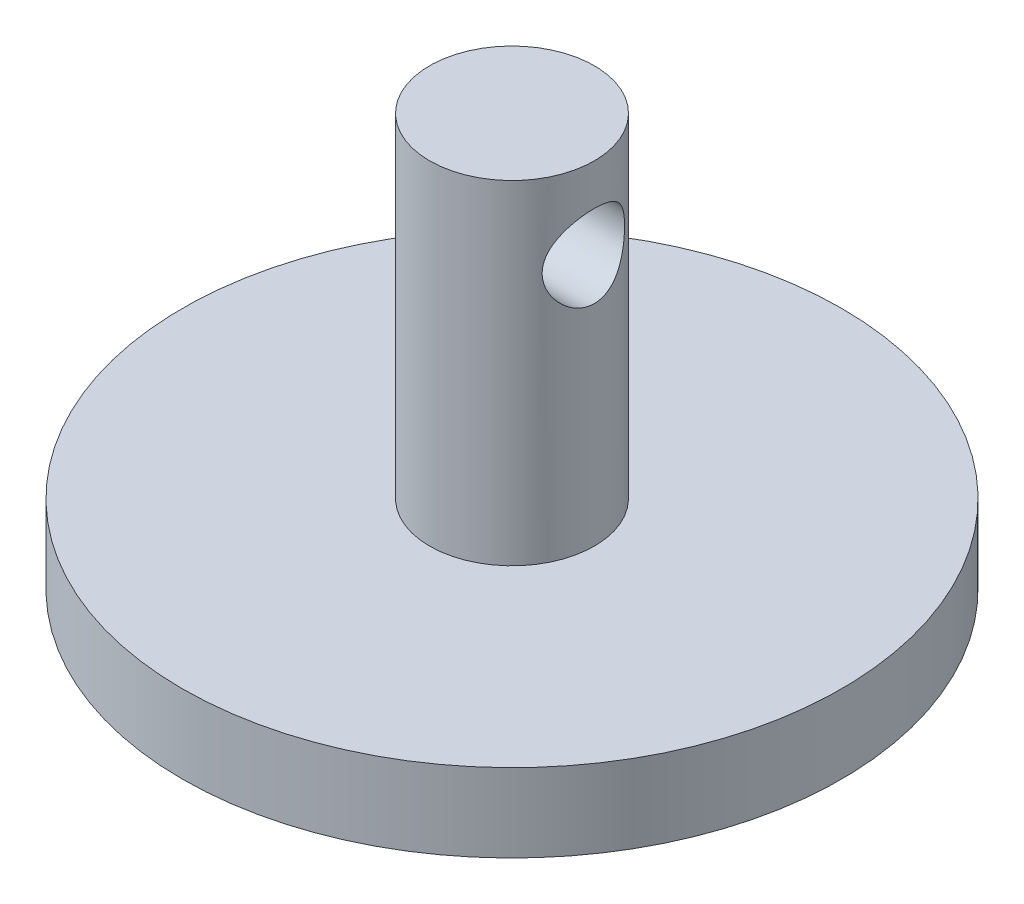
ISO-10303-21;
HEADER;
FILE_DESCRIPTION(('STEP AP214'),'2;1');
FILE_NAME('part.step','',(''),(''),'','','');
FILE_SCHEMA(('AUTOMOTIVE_DESIGN { 1 0 10303 214 1 1 1 1 }'));
ENDSEC;
DATA;
#1=APPLICATION_CONTEXT('core data for automotive mechanical design processes');
#2=APPLICATION_PROTOCOL_DEFINITION('international standard','automotive_design',2000,#1);
#3=PRODUCT_CONTEXT('',#1,'mechanical');
#4=PRODUCT('Part','Part','',(#3));
#5=PRODUCT_RELATED_PRODUCT_CATEGORY('part','',(#4));
#6=PRODUCT_DEFINITION_FORMATION('','',#4);
#7=PRODUCT_DEFINITION_CONTEXT('part definition',#1,'design');
#8=PRODUCT_DEFINITION('design','',#6,#7);
#9=PRODUCT_DEFINITION_SHAPE('','',#8);
#10=(LENGTH_UNIT() NAMED_UNIT(*) SI_UNIT(.MILLI.,.METRE.));
#11=(NAMED_UNIT(*) PLANE_ANGLE_UNIT() SI_UNIT($,.RADIAN.));
#12=(NAMED_UNIT(*) SI_UNIT($,.STERADIAN.) SOLID_ANGLE_UNIT());
#13=UNCERTAINTY_MEASURE_WITH_UNIT(LENGTH_MEASURE(1.E-05),#10,'distance_accuracy_value','');
#14=(GEOMETRIC_REPRESENTATION_CONTEXT(3) GLOBAL_UNCERTAINTY_ASSIGNED_CONTEXT((#13)) GLOBAL_UNIT_ASSIGNED_CONTEXT((#10,
#11,#12)) REPRESENTATION_CONTEXT('',''));
#15=CARTESIAN_POINT('',(0.,0.,0.));
#16=DIRECTION('',(0.,0.,1.));
#17=DIRECTION('',(1.,0.,0.));
#18=AXIS2_PLACEMENT_3D('',#15,#16,#17);
#19=CARTESIAN_POINT('',(0.,0.,0.));
#20=DIRECTION('',(0.,-1.,0.));
#21=DIRECTION('',(0.,0.,-1.));
#22=AXIS2_PLACEMENT_3D('',#19,#20,#21);
#23=PLANE('',#22);
#24=CARTESIAN_POINT('',(0.,0.,0.));
#25=DIRECTION('',(0.,1.,0.));
#26=DIRECTION('',(0.,0.,1.));
#27=AXIS2_PLACEMENT_3D('',#24,#25,#26);
#28=CIRCLE('',#27,8.);
#29=CARTESIAN_POINT('',(0.,0.,8.));
#30=VERTEX_POINT('',#29);
#31=EDGE_CURVE('E10',#30,#30,#28,.T.);
#32=ORIENTED_EDGE('',*,*,#31,.F.);
#33=EDGE_LOOP('',(#32));
#34=FACE_BOUND('',#33,.T.);
#35=ADVANCED_FACE('F34',(#34),#23,.T.);
#36=CARTESIAN_POINT('',(0.,10.,0.));
#37=DIRECTION('',(0.,1.,0.));
#38=DIRECTION('',(0.,0.,1.));
#39=AXIS2_PLACEMENT_3D('',#36,#37,#38);
#40=CYLINDRICAL_SURFACE('',#39,8.);
#41=ORIENTED_EDGE('',*,*,#31,.T.);
#42=EDGE_LOOP('',(#41));
#43=FACE_BOUND('',#42,.T.);
#44=CARTESIAN_POINT('',(0.,1.9,0.));
#45=DIRECTION('',(0.,1.,0.));
#46=DIRECTION('',(0.,0.,1.));
#47=AXIS2_PLACEMENT_3D('',#44,#45,#46);
#48=CIRCLE('',#47,8.);
#49=CARTESIAN_POINT('',(0.,1.9,8.));
#50=VERTEX_POINT('',#49);
#51=EDGE_CURVE('E46',#50,#50,#48,.T.);
#52=ORIENTED_EDGE('',*,*,#51,.F.);
#53=EDGE_LOOP('',(#52));
#54=FACE_BOUND('',#53,.T.);
#55=ADVANCED_FACE('F78',(#43,#54),#40,.T.);
#56=CARTESIAN_POINT('',(0.,1.9,8.));
#57=DIRECTION('',(0.,1.,0.));
#58=DIRECTION('',(0.,0.,1.));
#59=AXIS2_PLACEMENT_3D('',#56,#57,#58);
#60=PLANE('',#59);
#61=ORIENTED_EDGE('',*,*,#51,.T.);
#62=EDGE_LOOP('',(#61));
#63=FACE_BOUND('',#62,.T.);
#64=CARTESIAN_POINT('',(0.,1.9,0.));
#65=DIRECTION('',(0.,1.,0.));
#66=DIRECTION('',(0.,0.,1.));
#67=AXIS2_PLACEMENT_3D('',#64,#65,#66);
#68=CIRCLE('',#67,2.);
#69=CARTESIAN_POINT('',(0.,1.9,2.));
#70=VERTEX_POINT('',#69);
#71=EDGE_CURVE('E51',#70,#70,#68,.T.);
#72=ORIENTED_EDGE('',*,*,#71,.F.);
#73=EDGE_LOOP('',(#72));
#74=FACE_BOUND('',#73,.T.);
#75=ADVANCED_FACE('F74',(#63,#74),#60,.T.);
#76=CARTESIAN_POINT('',(0.,10.,0.));
#77=DIRECTION('',(0.,1.,0.));
#78=DIRECTION('',(0.,0.,1.));
#79=AXIS2_PLACEMENT_3D('',#76,#77,#78);
#80=CYLINDRICAL_SURFACE('',#79,2.);
#81=CARTESIAN_POINT('',(-1.73205080756888,8.,-1.));
#82=CARTESIAN_POINT('',(-1.73205534728459,7.94789219180475,-0.999996363074532));
#83=CARTESIAN_POINT('',(-1.73443801187756,7.89571858847496,-0.995899970733217));
#84=CARTESIAN_POINT('',(-1.74362366452052,7.79297273532285,-0.979723209898054));
#85=CARTESIAN_POINT('',(-1.75043594055559,7.74240408495659,-0.967626064554179));
#86=CARTESIAN_POINT('',(-1.76749346605398,7.64454833565606,-0.936099948699813));
#87=CARTESIAN_POINT('',(-1.77772043473252,7.59724534752641,-0.916709952493731));
#88=CARTESIAN_POINT('',(-1.80042664816858,7.50657579800328,-0.871267525376372));
#89=CARTESIAN_POINT('',(-1.81290601476065,7.46320944973754,-0.845214734035774));
#90=CARTESIAN_POINT('',(-1.83996869057441,7.3776942714425,-0.784666540530879));
#91=CARTESIAN_POINT('',(-1.85464063637954,7.33594086432646,-0.749652036143771));
#92=CARTESIAN_POINT('',(-1.88371982785706,7.25859161159329,-0.673253807614469));
#93=CARTESIAN_POINT('',(-1.8981269383125,7.22299883741648,-0.631866925782293));
#94=CARTESIAN_POINT('',(-1.92621476952949,7.15663284885234,-0.540489563414546));
#95=CARTESIAN_POINT('',(-1.93978106418172,7.12634623214047,-0.490107189012575));
#96=CARTESIAN_POINT('',(-1.96350756099529,7.07485914675424,-0.384157026599505));
#97=CARTESIAN_POINT('',(-1.97366991183742,7.05365294386283,-0.328592538138156));
#98=CARTESIAN_POINT('',(-1.98880461244237,7.0224953386989,-0.218044943925978));
#99=CARTESIAN_POINT('',(-1.99409480220892,7.01185047364447,-0.163301790488818));
#100=CARTESIAN_POINT('',(-2.00007583846067,6.99983388132496,-0.0525706286978487));
#101=CARTESIAN_POINT('',(-2.0007694678459,6.99845654320429,0.00341660584373789));
#102=CARTESIAN_POINT('',(-1.9976298191645,7.00474667397035,0.10983252442375));
#103=CARTESIAN_POINT('',(-1.9941849589216,7.01163801552122,0.160321199176791));
#104=CARTESIAN_POINT('',(-1.98374245259747,7.03288084390466,0.259313771918322));
#105=CARTESIAN_POINT('',(-1.97674454066394,7.04723288897622,0.307817521093925));
#106=CARTESIAN_POINT('',(-1.95971583287654,7.08308256608981,0.402309391569553));
#107=CARTESIAN_POINT('',(-1.94964441529199,7.10467631317207,0.448253423515178));
#108=CARTESIAN_POINT('',(-1.92737645986687,7.15426341620149,0.535976801513328));
#109=CARTESIAN_POINT('',(-1.91517916157484,7.18225906330235,0.577754648838645));
#110=CARTESIAN_POINT('',(-1.88844394399229,7.24689535153302,0.660173660898195));
#111=CARTESIAN_POINT('',(-1.87379375998175,7.28410302832601,0.70033407502936));
#112=CARTESIAN_POINT('',(-1.84454340586812,7.36458972493018,0.77410437029778));
#113=CARTESIAN_POINT('',(-1.82994328265629,7.40787337227406,0.807709211574231));
#114=CARTESIAN_POINT('',(-1.80144156092485,7.50264819242409,0.869505334642211));
#115=CARTESIAN_POINT('',(-1.78764319990708,7.55448602305421,0.897217314978052));
#116=CARTESIAN_POINT('',(-1.76375450278576,7.662937671359,0.943319113001232));
#117=CARTESIAN_POINT('',(-1.75366030046067,7.71954643301756,0.96171865821089));
#118=CARTESIAN_POINT('',(-1.73944635817034,7.83121451128279,0.98718021102504));
#119=CARTESIAN_POINT('',(-1.73491655848496,7.88604111904355,0.995025122119976));
#120=CARTESIAN_POINT('',(-1.73117919361609,7.99640134151654,1.00151694661143));
#121=CARTESIAN_POINT('',(-1.73196786889312,8.05193442911978,1.00017035731503));
#122=CARTESIAN_POINT('',(-1.73834336540585,8.15565391857873,0.989036043343967));
#123=CARTESIAN_POINT('',(-1.74339587506654,8.20397945110792,0.980187816712468));
#124=CARTESIAN_POINT('',(-1.75694021551341,8.29836778627096,0.955696284632442));
#125=CARTESIAN_POINT('',(-1.76543316005034,8.34442985074661,0.940050778623615));
#126=CARTESIAN_POINT('',(-1.78536222079657,8.4354113309027,0.901647588604887));
#127=CARTESIAN_POINT('',(-1.79691643243063,8.48017901685355,0.878594063692725));
#128=CARTESIAN_POINT('',(-1.8215611949725,8.56546927153899,0.826287064015806));
#129=CARTESIAN_POINT('',(-1.83465253355148,8.60598964351328,0.797030404332217));
#130=CARTESIAN_POINT('',(-1.86287998456336,8.68697876752355,0.728837167198855));
#131=CARTESIAN_POINT('',(-1.87806583154289,8.72679715071766,0.689145272314968));
#132=CARTESIAN_POINT('',(-1.90734234977892,8.79941223799359,0.60340449539829));
#133=CARTESIAN_POINT('',(-1.92143265007709,8.83220657023054,0.557353474655348));
#134=CARTESIAN_POINT('',(-1.94741361690957,8.8905737259501,0.458535362558758));
#135=CARTESIAN_POINT('',(-1.95923641672029,8.91593311821091,0.405623097574114));
#136=CARTESIAN_POINT('',(-1.97883354959301,8.95713790385739,0.295522364641083));
#137=CARTESIAN_POINT('',(-1.98661143676373,8.97299165136631,0.238337701392177));
#138=CARTESIAN_POINT('',(-1.99667508181883,8.99336856417466,0.126979682330418));
#139=CARTESIAN_POINT('',(-1.99939927908191,8.99879787587611,0.0730114438504575));
#140=CARTESIAN_POINT('',(-2.00042130375131,9.0008432654544,-0.0351259859512031));
#141=CARTESIAN_POINT('',(-1.9987206806689,8.99746242852357,-0.0892951002950863));
#142=CARTESIAN_POINT('',(-1.99133968837923,8.98258359320438,-0.192537992317146));
#143=CARTESIAN_POINT('',(-1.9859289466799,8.97163515074233,-0.241712317811263));
#144=CARTESIAN_POINT('',(-1.97192093663423,8.94267300069703,-0.337445952183617));
#145=CARTESIAN_POINT('',(-1.96332321132796,8.92465827990655,-0.384004884955508));
#146=CARTESIAN_POINT('',(-1.9432593074812,8.88127294783403,-0.475423406244884));
#147=CARTESIAN_POINT('',(-1.93168617198799,8.85562067679216,-0.520125142700046));
#148=CARTESIAN_POINT('',(-1.90688133141826,8.79804206914095,-0.604774641814024));
#149=CARTESIAN_POINT('',(-1.89364886558361,8.76611285088433,-0.644720207414907));
#150=CARTESIAN_POINT('',(-1.86528610226628,8.6932028609773,-0.722914004156891));
#151=CARTESIAN_POINT('',(-1.85009799011698,8.65163751252281,-0.760597684539272));
#152=CARTESIAN_POINT('',(-1.82063076162852,8.56254927887023,-0.828663287394676));
#153=CARTESIAN_POINT('',(-1.80635245761865,8.51502117913232,-0.859038750010059));
#154=CARTESIAN_POINT('',(-1.77999605304916,8.41336335341905,-0.912431079785654));
#155=CARTESIAN_POINT('',(-1.7680017425627,8.35907246887126,-0.935185065960939));
#156=CARTESIAN_POINT('',(-1.74866156328352,8.24666759566022,-0.970878709506412));
#157=CARTESIAN_POINT('',(-1.74130016147702,8.18856711108731,-0.983851191175347));
#158=CARTESIAN_POINT('',(-1.7352927260179,8.10819464434801,-0.994367007864415));
#159=CARTESIAN_POINT('',(-1.73408129005152,8.08663210560212,-0.996476104963851));
#160=CARTESIAN_POINT('',(-1.7324593588775,8.04338351931776,-0.999293405089963));
#161=CARTESIAN_POINT('',(-1.73204891725109,8.02169746361413,-1.00000151439987));
#162=CARTESIAN_POINT('',(-1.73205080756888,8.,-1.));
#163=B_SPLINE_CURVE_WITH_KNOTS('',3,(#81,#82,#83,#84,#85,#86,#87,#88,#89,#90,#91,#92,#93,#94,
#95,#96,#97,#98,#99,#100,#101,#102,#103,#104,#105,#106,#107,#108,#109,#110,#111,#112,#113,#114,
#115,#116,#117,#118,#119,#120,#121,#122,#123,#124,#125,#126,#127,#128,#129,#130,#131,#132,#133,
#134,#135,#136,#137,#138,#139,#140,#141,#142,#143,#144,#145,#146,#147,#148,#149,#150,#151,#152,
#153,#154,#155,#156,#157,#158,#159,#160,#161,#162),.UNSPECIFIED.,.T.,.F.,(4,2,2,2,2,2,2,2,2,2,2,
2,2,2,2,2,2,2,2,2,2,2,2,2,2,2,2,2,2,2,2,2,2,2,2,2,2,2,2,2,4),(0.,0.156232122594715,
0.312792892824805,0.468528595918885,0.624272725445149,0.792862312498233,0.96153571084371,
1.14157892238763,1.32150826963891,1.48863484967935,1.6556602368604,1.80816097484538,
1.96067312517455,2.11529534731147,2.26997299350272,2.43927191456891,2.60870048245919,
2.78888841729448,2.96888774211705,3.13462290854212,3.30024093188373,3.44774183424025,
3.59529052436063,3.74967296406088,3.90413486220047,4.07806743580613,4.25205864978202,
4.43064181412966,4.60906779808772,4.77112270389487,4.93312086793972,5.08444424871493,
5.23578933512013,5.39360750719472,5.55149830100719,5.72510241850068,5.89885942845154,
6.07810749038605,6.2567513300276,6.3218013518531,6.38685572494541),.UNSPECIFIED.);
#164=CARTESIAN_POINT('',(-1.73205080756888,8.,-1.));
#165=VERTEX_POINT('',#164);
#166=EDGE_CURVE('E37',#165,#165,#163,.T.);
#167=ORIENTED_EDGE('',*,*,#166,.F.);
#168=EDGE_LOOP('',(#167));
#169=FACE_BOUND('',#168,.T.);
#170=CARTESIAN_POINT('',(1.73205080756888,8.,-1.));
#171=CARTESIAN_POINT('',(1.73205534728459,8.05210780819525,-0.999996363074532));
#172=CARTESIAN_POINT('',(1.73443801187756,8.10428141152505,-0.995899970733217));
#173=CARTESIAN_POINT('',(1.74362366452052,8.20702726467715,-0.979723209898054));
#174=CARTESIAN_POINT('',(1.75043594055559,8.25759591504341,-0.96762606455418));
#175=CARTESIAN_POINT('',(1.76749346605398,8.35545166434394,-0.936099948699813));
#176=CARTESIAN_POINT('',(1.77772043473252,8.40275465247359,-0.916709952493731));
#177=CARTESIAN_POINT('',(1.80042664816858,8.49342420199672,-0.871267525376372));
#178=CARTESIAN_POINT('',(1.81290601476065,8.53679055026246,-0.845214734035774));
#179=CARTESIAN_POINT('',(1.83996869057441,8.62230572855751,-0.78466654053088));
#180=CARTESIAN_POINT('',(1.85464063637953,8.66405913567354,-0.749652036143771));
#181=CARTESIAN_POINT('',(1.88371982785706,8.74140838840671,-0.673253807614469));
#182=CARTESIAN_POINT('',(1.8981269383125,8.77700116258352,-0.631866925782293));
#183=CARTESIAN_POINT('',(1.92621476952949,8.84336715114766,-0.540489563414547));
#184=CARTESIAN_POINT('',(1.93978106418172,8.87365376785953,-0.490107189012576));
#185=CARTESIAN_POINT('',(1.96350756099529,8.92514085324576,-0.384157026599506));
#186=CARTESIAN_POINT('',(1.97366991183742,8.94634705613717,-0.328592538138157));
#187=CARTESIAN_POINT('',(1.98880461244237,8.9775046613011,-0.218044943925979));
#188=CARTESIAN_POINT('',(1.99409480220892,8.98814952635553,-0.163301790488819));
#189=CARTESIAN_POINT('',(2.00007583846067,9.00016611867504,-0.0525706286978493));
#190=CARTESIAN_POINT('',(2.0007694678459,9.00154345679571,0.00341660584373763));
#191=CARTESIAN_POINT('',(1.9976298191645,8.99525332602965,0.10983252442375));
#192=CARTESIAN_POINT('',(1.9941849589216,8.98836198447878,0.160321199176791));
#193=CARTESIAN_POINT('',(1.98374245259747,8.96711915609534,0.259313771918322));
#194=CARTESIAN_POINT('',(1.97674454066394,8.95276711102378,0.307817521093925));
#195=CARTESIAN_POINT('',(1.95971583287654,8.91691743391019,0.402309391569553));
#196=CARTESIAN_POINT('',(1.94964441529199,8.89532368682793,0.448253423515178));
#197=CARTESIAN_POINT('',(1.92737645986687,8.84573658379851,0.535976801513328));
#198=CARTESIAN_POINT('',(1.91517916157484,8.81774093669765,0.577754648838645));
#199=CARTESIAN_POINT('',(1.88844394399229,8.75310464846699,0.660173660898194));
#200=CARTESIAN_POINT('',(1.87379375998175,8.71589697167399,0.70033407502936));
#201=CARTESIAN_POINT('',(1.84454340586812,8.63541027506983,0.774104370297779));
#202=CARTESIAN_POINT('',(1.82994328265629,8.59212662772594,0.80770921157423));
#203=CARTESIAN_POINT('',(1.80144156092485,8.49735180757591,0.869505334642211));
#204=CARTESIAN_POINT('',(1.78764319990708,8.44551397694579,0.897217314978051));
#205=CARTESIAN_POINT('',(1.76375450278576,8.337062328641,0.943319113001232));
#206=CARTESIAN_POINT('',(1.75366030046067,8.28045356698244,0.96171865821089));
#207=CARTESIAN_POINT('',(1.73944635817034,8.16878548871721,0.98718021102504));
#208=CARTESIAN_POINT('',(1.73491655848496,8.11395888095645,0.995025122119976));
#209=CARTESIAN_POINT('',(1.73117919361609,8.00359865848346,1.00151694661143));
#210=CARTESIAN_POINT('',(1.73196786889312,7.94806557088022,1.00017035731503));
#211=CARTESIAN_POINT('',(1.73834336540585,7.84434608142127,0.989036043343966));
#212=CARTESIAN_POINT('',(1.74339587506654,7.79602054889207,0.980187816712468));
#213=CARTESIAN_POINT('',(1.75694021551341,7.70163221372904,0.955696284632441));
#214=CARTESIAN_POINT('',(1.76543316005034,7.65557014925339,0.940050778623615));
#215=CARTESIAN_POINT('',(1.78536222079657,7.5645886690973,0.901647588604886));
#216=CARTESIAN_POINT('',(1.79691643243063,7.51982098314645,0.878594063692724));
#217=CARTESIAN_POINT('',(1.8215611949725,7.43453072846101,0.826287064015805));
#218=CARTESIAN_POINT('',(1.83465253355148,7.39401035648672,0.797030404332217));
#219=CARTESIAN_POINT('',(1.86287998456336,7.31302123247645,0.728837167198854));
#220=CARTESIAN_POINT('',(1.87806583154289,7.27320284928234,0.689145272314967));
#221=CARTESIAN_POINT('',(1.90734234977892,7.20058776200641,0.603404495398289));
#222=CARTESIAN_POINT('',(1.92143265007709,7.16779342976946,0.557353474655348));
#223=CARTESIAN_POINT('',(1.94741361690957,7.1094262740499,0.458535362558757));
#224=CARTESIAN_POINT('',(1.95923641672029,7.08406688178909,0.405623097574113));
#225=CARTESIAN_POINT('',(1.97883354959301,7.04286209614261,0.295522364641082));
#226=CARTESIAN_POINT('',(1.98661143676373,7.02700834863369,0.238337701392176));
#227=CARTESIAN_POINT('',(1.99667508181883,7.00663143582534,0.126979682330418));
#228=CARTESIAN_POINT('',(1.99939927908191,7.00120212412389,0.0730114438504575));
#229=CARTESIAN_POINT('',(2.00042130375131,6.9991567345456,-0.0351259859512032));
#230=CARTESIAN_POINT('',(1.9987206806689,7.00253757147644,-0.0892951002950864));
#231=CARTESIAN_POINT('',(1.99133968837923,7.01741640679562,-0.192537992317147));
#232=CARTESIAN_POINT('',(1.9859289466799,7.02836484925767,-0.241712317811263));
#233=CARTESIAN_POINT('',(1.97192093663423,7.05732699930297,-0.337445952183617));
#234=CARTESIAN_POINT('',(1.96332321132796,7.07534172009345,-0.384004884955508));
#235=CARTESIAN_POINT('',(1.9432593074812,7.11872705216597,-0.475423406244884));
#236=CARTESIAN_POINT('',(1.93168617198799,7.14437932320784,-0.520125142700046));
#237=CARTESIAN_POINT('',(1.90688133141826,7.20195793085905,-0.604774641814024));
#238=CARTESIAN_POINT('',(1.89364886558361,7.23388714911567,-0.644720207414907));
#239=CARTESIAN_POINT('',(1.86528610226628,7.3067971390227,-0.722914004156891));
#240=CARTESIAN_POINT('',(1.85009799011698,7.34836248747719,-0.760597684539272));
#241=CARTESIAN_POINT('',(1.82063076162852,7.43745072112977,-0.828663287394675));
#242=CARTESIAN_POINT('',(1.80635245761865,7.48497882086768,-0.859038750010058));
#243=CARTESIAN_POINT('',(1.77999605304916,7.58663664658096,-0.912431079785655));
#244=CARTESIAN_POINT('',(1.7680017425627,7.64092753112874,-0.93518506596094));
#245=CARTESIAN_POINT('',(1.74866156328351,7.75333240433978,-0.970878709506412));
#246=CARTESIAN_POINT('',(1.74130016147702,7.81143288891269,-0.983851191175347));
#247=CARTESIAN_POINT('',(1.7352927260179,7.891805355652,-0.994367007864415));
#248=CARTESIAN_POINT('',(1.73408129005152,7.91336789439789,-0.996476104963851));
#249=CARTESIAN_POINT('',(1.7324593588775,7.95661648068225,-0.999293405089963));
#250=CARTESIAN_POINT('',(1.73204891725109,7.97830253638588,-1.00000151439987));
#251=CARTESIAN_POINT('',(1.73205080756888,8.,-1.));
#252=B_SPLINE_CURVE_WITH_KNOTS('',3,(#170,#171,#172,#173,#174,#175,#176,#177,#178,#179,#180,
#181,#182,#183,#184,#185,#186,#187,#188,#189,#190,#191,#192,#193,#194,#195,#196,#197,#198,#199,
#200,#201,#202,#203,#204,#205,#206,#207,#208,#209,#210,#211,#212,#213,#214,#215,#216,#217,#218,
#219,#220,#221,#222,#223,#224,#225,#226,#227,#228,#229,#230,#231,#232,#233,#234,#235,#236,#237,
#238,#239,#240,#241,#242,#243,#244,#245,#246,#247,#248,#249,#250,#251),.UNSPECIFIED.,.T.,.F.,(4,
2,2,2,2,2,2,2,2,2,2,2,2,2,2,2,2,2,2,2,2,2,2,2,2,2,2,2,2,2,2,2,2,2,2,2,2,2,2,2,4),(0.,
0.156232122594715,0.312792892824805,0.468528595918886,0.62427272544515,0.792862312498233,
0.96153571084371,1.14157892238763,1.32150826963891,1.48863484967935,1.6556602368604,
1.80816097484538,1.96067312517455,2.11529534731147,2.26997299350272,2.43927191456891,
2.60870048245918,2.78888841729448,2.96888774211705,3.13462290854212,3.30024093188373,
3.44774183424026,3.59529052436063,3.74967296406088,3.90413486220047,4.07806743580613,
4.25205864978202,4.43064181412966,4.60906779808772,4.77112270389487,4.93312086793972,
5.08444424871493,5.23578933512013,5.39360750719472,5.55149830100719,5.72510241850068,
5.89885942845154,6.07810749038605,6.2567513300276,6.3218013518531,6.38685572494541),.UNSPECIFIED.);
#253=CARTESIAN_POINT('',(1.73205080756888,8.,-1.));
#254=VERTEX_POINT('',#253);
#255=EDGE_CURVE('E54',#254,#254,#252,.T.);
#256=ORIENTED_EDGE('',*,*,#255,.F.);
#257=EDGE_LOOP('',(#256));
#258=FACE_BOUND('',#257,.T.);
#259=ORIENTED_EDGE('',*,*,#71,.T.);
#260=EDGE_LOOP('',(#259));
#261=FACE_BOUND('',#260,.T.);
#262=CARTESIAN_POINT('',(0.,10.,0.));
#263=DIRECTION('',(0.,1.,0.));
#264=DIRECTION('',(0.,0.,1.));
#265=AXIS2_PLACEMENT_3D('',#262,#263,#264);
#266=CIRCLE('',#265,2.);
#267=CARTESIAN_POINT('',(0.,10.,2.));
#268=VERTEX_POINT('',#267);
#269=EDGE_CURVE('E93',#268,#268,#266,.T.);
#270=ORIENTED_EDGE('',*,*,#269,.F.);
#271=EDGE_LOOP('',(#270));
#272=FACE_BOUND('',#271,.T.);
#273=ADVANCED_FACE('F59',(#169,#258,#261,#272),#80,.T.);
#274=CARTESIAN_POINT('',(0.,10.,2.));
#275=DIRECTION('',(0.,1.,0.));
#276=DIRECTION('',(0.,0.,1.));
#277=AXIS2_PLACEMENT_3D('',#274,#275,#276);
#278=PLANE('',#277);
#279=ORIENTED_EDGE('',*,*,#269,.T.);
#280=EDGE_LOOP('',(#279));
#281=FACE_BOUND('',#280,.T.);
#282=ADVANCED_FACE('F66',(#281),#278,.T.);
#283=CARTESIAN_POINT('',(-8.,8.,0.));
#284=DIRECTION('',(1.,0.,0.));
#285=DIRECTION('',(0.,0.,-1.));
#286=AXIS2_PLACEMENT_3D('',#283,#284,#285);
#287=CYLINDRICAL_SURFACE('',#286,1.);
#288=ORIENTED_EDGE('',*,*,#166,.T.);
#289=EDGE_LOOP('',(#288));
#290=FACE_BOUND('',#289,.T.);
#291=ORIENTED_EDGE('',*,*,#255,.T.);
#292=EDGE_LOOP('',(#291));
#293=FACE_BOUND('',#292,.T.);
#294=ADVANCED_FACE('F63',(#290,#293),#287,.F.);
#295=CLOSED_SHELL('',(#35,#55,#75,#273,#282,#294));
#296=MANIFOLD_SOLID_BREP('B2',#295);
#297=ADVANCED_BREP_SHAPE_REPRESENTATION('',(#18,#296),#14);
#298=SHAPE_DEFINITION_REPRESENTATION(#9,#297);
ENDSEC;
END-ISO-10303-21;
